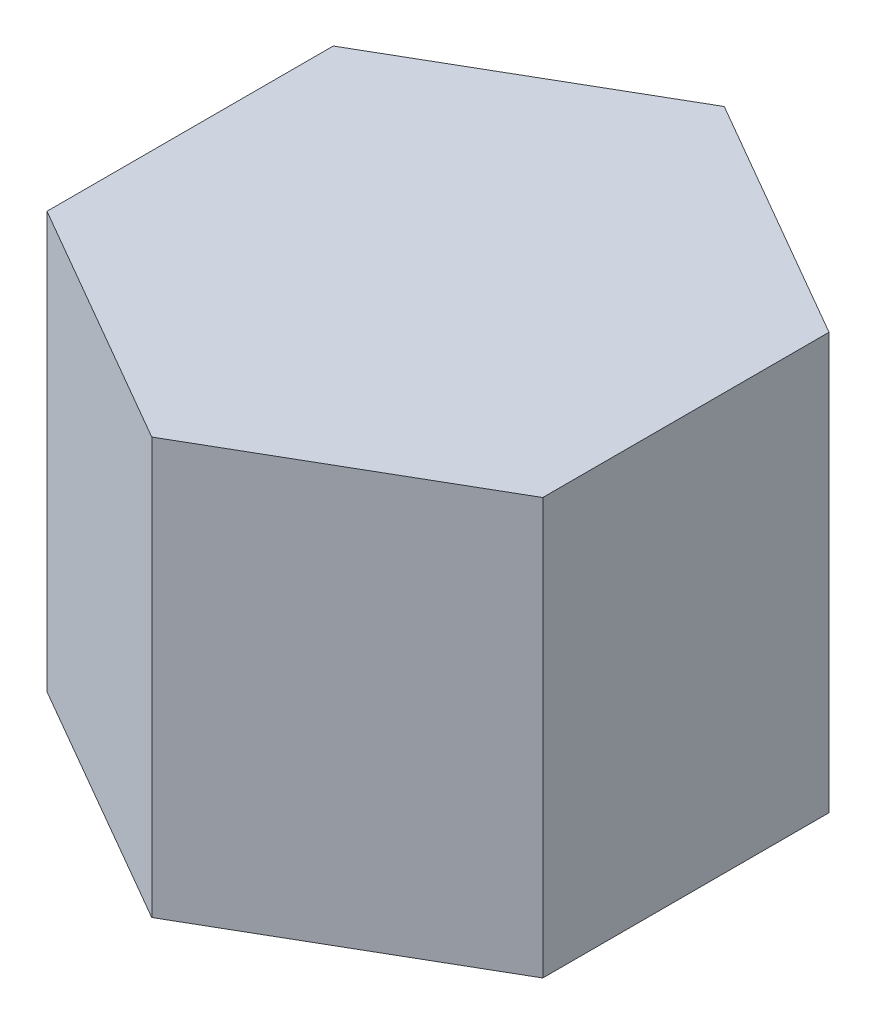
ISO-10303-21;
HEADER;
FILE_DESCRIPTION(('STEP AP214'),'2;1');
FILE_NAME('part.step','',(''),(''),'','','');
FILE_SCHEMA(('AUTOMOTIVE_DESIGN { 1 0 10303 214 1 1 1 1 }'));
ENDSEC;
DATA;
#1=APPLICATION_CONTEXT('core data for automotive mechanical design processes');
#2=APPLICATION_PROTOCOL_DEFINITION('international standard','automotive_design',2000,#1);
#3=PRODUCT_CONTEXT('',#1,'mechanical');
#4=PRODUCT('Part','Part','',(#3));
#5=PRODUCT_RELATED_PRODUCT_CATEGORY('part','',(#4));
#6=PRODUCT_DEFINITION_FORMATION('','',#4);
#7=PRODUCT_DEFINITION_CONTEXT('part definition',#1,'design');
#8=PRODUCT_DEFINITION('design','',#6,#7);
#9=PRODUCT_DEFINITION_SHAPE('','',#8);
#10=(LENGTH_UNIT() NAMED_UNIT(*) SI_UNIT(.MILLI.,.METRE.));
#11=(NAMED_UNIT(*) PLANE_ANGLE_UNIT() SI_UNIT($,.RADIAN.));
#12=(NAMED_UNIT(*) SI_UNIT($,.STERADIAN.) SOLID_ANGLE_UNIT());
#13=UNCERTAINTY_MEASURE_WITH_UNIT(LENGTH_MEASURE(1.E-05),#10,'distance_accuracy_value','');
#14=(GEOMETRIC_REPRESENTATION_CONTEXT(3) GLOBAL_UNCERTAINTY_ASSIGNED_CONTEXT((#13)) GLOBAL_UNIT_ASSIGNED_CONTEXT((#10,
#11,#12)) REPRESENTATION_CONTEXT('',''));
#15=CARTESIAN_POINT('',(0.,0.,0.));
#16=DIRECTION('',(0.,0.,1.));
#17=DIRECTION('',(1.,0.,0.));
#18=AXIS2_PLACEMENT_3D('',#15,#16,#17);
#19=CARTESIAN_POINT('',(208.839551417381,-147.556598747966,296.012098239417));
#20=DIRECTION('',(-0.500000000000062,0.,-0.866025403784403));
#21=DIRECTION('',(-0.866025403784403,0.,0.500000000000062));
#22=AXIS2_PLACEMENT_3D('',#19,#20,#21);
#23=PLANE('',#22);
#24=CARTESIAN_POINT('',(209.142660308706,-147.047793579175,295.837098239417));
#25=DIRECTION('',(-0.866025403784403,0.,0.500000000000062));
#26=VECTOR('',#25,1.);
#27=LINE('',#24,#26);
#28=CARTESIAN_POINT('',(209.142660308706,-147.047793579175,295.837098239417));
#29=VERTEX_POINT('',#28);
#30=CARTESIAN_POINT('',(208.839551417382,-147.047793579175,296.012098239417));
#31=VERTEX_POINT('',#30);
#32=EDGE_CURVE('E170',#29,#31,#27,.T.);
#33=ORIENTED_EDGE('',*,*,#32,.T.);
#34=CARTESIAN_POINT('',(208.839551417382,-147.556598747966,296.012098239417));
#35=DIRECTION('',(0.,1.,0.));
#36=VECTOR('',#35,1.);
#37=LINE('',#34,#36);
#38=CARTESIAN_POINT('',(208.839551417382,-147.556598747966,296.012098239417));
#39=VERTEX_POINT('',#38);
#40=EDGE_CURVE('E35',#39,#31,#37,.T.);
#41=ORIENTED_EDGE('',*,*,#40,.F.);
#42=CARTESIAN_POINT('',(209.142660308706,-147.556598747966,295.837098239417));
#43=DIRECTION('',(-0.866025403784403,0.,0.500000000000062));
#44=VECTOR('',#43,1.);
#45=LINE('',#42,#44);
#46=CARTESIAN_POINT('',(209.142660308706,-147.556598747966,295.837098239417));
#47=VERTEX_POINT('',#46);
#48=EDGE_CURVE('E159',#47,#39,#45,.T.);
#49=ORIENTED_EDGE('',*,*,#48,.F.);
#50=CARTESIAN_POINT('',(209.142660308706,-147.556598747966,295.837098239417));
#51=DIRECTION('',(0.,1.,0.));
#52=VECTOR('',#51,1.);
#53=LINE('',#50,#52);
#54=EDGE_CURVE('E10',#47,#29,#53,.T.);
#55=ORIENTED_EDGE('',*,*,#54,.T.);
#56=EDGE_LOOP('',(#33,#41,#49,#55));
#57=FACE_BOUND('',#56,.T.);
#58=ADVANCED_FACE('F16',(#57),#23,.F.);
#59=CARTESIAN_POINT('',(209.142660308706,-147.556598747966,291.594471220494));
#60=DIRECTION('',(-1.,0.,0.));
#61=DIRECTION('',(0.,-1.,0.));
#62=AXIS2_PLACEMENT_3D('',#59,#60,#61);
#63=PLANE('',#62);
#64=CARTESIAN_POINT('',(209.142660308706,-147.047793579175,295.487098239417));
#65=DIRECTION('',(0.,0.,1.));
#66=VECTOR('',#65,1.);
#67=LINE('',#64,#66);
#68=CARTESIAN_POINT('',(209.142660308706,-147.047793579175,295.487098239417));
#69=VERTEX_POINT('',#68);
#70=EDGE_CURVE('E167',#69,#29,#67,.T.);
#71=ORIENTED_EDGE('',*,*,#70,.T.);
#72=ORIENTED_EDGE('',*,*,#54,.F.);
#73=CARTESIAN_POINT('',(209.142660308706,-147.556598747966,295.487098239417));
#74=DIRECTION('',(0.,0.,1.));
#75=VECTOR('',#74,1.);
#76=LINE('',#73,#75);
#77=CARTESIAN_POINT('',(209.142660308706,-147.556598747966,295.487098239417));
#78=VERTEX_POINT('',#77);
#79=EDGE_CURVE('E156',#78,#47,#76,.T.);
#80=ORIENTED_EDGE('',*,*,#79,.F.);
#81=CARTESIAN_POINT('',(209.142660308706,-147.556598747966,295.487098239417));
#82=DIRECTION('',(0.,1.,0.));
#83=VECTOR('',#82,1.);
#84=LINE('',#81,#83);
#85=EDGE_CURVE('E27',#78,#69,#84,.T.);
#86=ORIENTED_EDGE('',*,*,#85,.T.);
#87=EDGE_LOOP('',(#71,#72,#80,#86));
#88=FACE_BOUND('',#87,.T.);
#89=ADVANCED_FACE('F189',(#88),#63,.F.);
#90=CARTESIAN_POINT('',(209.142660308706,-147.556598747966,295.487098239417));
#91=DIRECTION('',(-0.500000000000096,0.,0.866025403784383));
#92=DIRECTION('',(0.866025403784383,0.,0.500000000000096));
#93=AXIS2_PLACEMENT_3D('',#90,#91,#92);
#94=PLANE('',#93);
#95=CARTESIAN_POINT('',(208.839551417382,-147.047793579175,295.312098239417));
#96=DIRECTION('',(0.866025403784383,0.,0.500000000000096));
#97=VECTOR('',#96,1.);
#98=LINE('',#95,#97);
#99=CARTESIAN_POINT('',(208.839551417382,-147.047793579175,295.312098239417));
#100=VERTEX_POINT('',#99);
#101=EDGE_CURVE('E163',#100,#69,#98,.T.);
#102=ORIENTED_EDGE('',*,*,#101,.T.);
#103=ORIENTED_EDGE('',*,*,#85,.F.);
#104=CARTESIAN_POINT('',(208.839551417382,-147.556598747966,295.312098239417));
#105=DIRECTION('',(0.866025403784383,0.,0.500000000000096));
#106=VECTOR('',#105,1.);
#107=LINE('',#104,#106);
#108=CARTESIAN_POINT('',(208.839551417382,-147.556598747966,295.312098239417));
#109=VERTEX_POINT('',#108);
#110=EDGE_CURVE('E106',#109,#78,#107,.T.);
#111=ORIENTED_EDGE('',*,*,#110,.F.);
#112=CARTESIAN_POINT('',(208.839551417382,-147.556598747966,295.312098239417));
#113=DIRECTION('',(0.,1.,0.));
#114=VECTOR('',#113,1.);
#115=LINE('',#112,#114);
#116=EDGE_CURVE('E94',#109,#100,#115,.T.);
#117=ORIENTED_EDGE('',*,*,#116,.T.);
#118=EDGE_LOOP('',(#102,#103,#111,#117));
#119=FACE_BOUND('',#118,.T.);
#120=ADVANCED_FACE('F198',(#119),#94,.F.);
#121=CARTESIAN_POINT('',(208.839551417382,-147.556598747966,295.312098239417));
#122=DIRECTION('',(0.499999999999978,0.,0.866025403784452));
#123=DIRECTION('',(0.866025403784452,0.,-0.499999999999978));
#124=AXIS2_PLACEMENT_3D('',#121,#122,#123);
#125=PLANE('',#124);
#126=CARTESIAN_POINT('',(208.536442526057,-147.047793579175,295.487098239417));
#127=DIRECTION('',(0.866025403784452,0.,-0.499999999999978));
#128=VECTOR('',#127,1.);
#129=LINE('',#126,#128);
#130=CARTESIAN_POINT('',(208.536442526057,-147.047793579175,295.487098239417));
#131=VERTEX_POINT('',#130);
#132=EDGE_CURVE('E162',#131,#100,#129,.T.);
#133=ORIENTED_EDGE('',*,*,#132,.T.);
#134=ORIENTED_EDGE('',*,*,#116,.F.);
#135=CARTESIAN_POINT('',(208.536442526057,-147.556598747966,295.487098239417));
#136=DIRECTION('',(0.866025403784452,0.,-0.499999999999978));
#137=VECTOR('',#136,1.);
#138=LINE('',#135,#137);
#139=CARTESIAN_POINT('',(208.536442526057,-147.556598747966,295.487098239417));
#140=VERTEX_POINT('',#139);
#141=EDGE_CURVE('E98',#140,#109,#138,.T.);
#142=ORIENTED_EDGE('',*,*,#141,.F.);
#143=CARTESIAN_POINT('',(208.536442526057,-147.556598747966,295.487098239417));
#144=DIRECTION('',(0.,1.,0.));
#145=VECTOR('',#144,1.);
#146=LINE('',#143,#145);
#147=EDGE_CURVE('E79',#140,#131,#146,.T.);
#148=ORIENTED_EDGE('',*,*,#147,.T.);
#149=EDGE_LOOP('',(#133,#134,#142,#148));
#150=FACE_BOUND('',#149,.T.);
#151=ADVANCED_FACE('F100',(#150),#125,.F.);
#152=CARTESIAN_POINT('',(208.536442526057,-147.556598747966,291.594471220494));
#153=DIRECTION('',(1.,0.,0.));
#154=DIRECTION('',(0.,1.,0.));
#155=AXIS2_PLACEMENT_3D('',#152,#153,#154);
#156=PLANE('',#155);
#157=CARTESIAN_POINT('',(208.536442526057,-147.047793579175,295.837098239417));
#158=DIRECTION('',(0.,0.,-1.));
#159=VECTOR('',#158,1.);
#160=LINE('',#157,#159);
#161=CARTESIAN_POINT('',(208.536442526057,-147.047793579175,295.837098239417));
#162=VERTEX_POINT('',#161);
#163=EDGE_CURVE('E88',#162,#131,#160,.T.);
#164=ORIENTED_EDGE('',*,*,#163,.T.);
#165=ORIENTED_EDGE('',*,*,#147,.F.);
#166=CARTESIAN_POINT('',(208.536442526057,-147.556598747966,295.837098239417));
#167=DIRECTION('',(0.,0.,-1.));
#168=VECTOR('',#167,1.);
#169=LINE('',#166,#168);
#170=CARTESIAN_POINT('',(208.536442526057,-147.556598747966,295.837098239417));
#171=VERTEX_POINT('',#170);
#172=EDGE_CURVE('E84',#171,#140,#169,.T.);
#173=ORIENTED_EDGE('',*,*,#172,.F.);
#174=CARTESIAN_POINT('',(208.536442526057,-147.556598747966,295.837098239417));
#175=DIRECTION('',(0.,1.,0.));
#176=VECTOR('',#175,1.);
#177=LINE('',#174,#176);
#178=EDGE_CURVE('E58',#171,#162,#177,.T.);
#179=ORIENTED_EDGE('',*,*,#178,.T.);
#180=EDGE_LOOP('',(#164,#165,#173,#179));
#181=FACE_BOUND('',#180,.T.);
#182=ADVANCED_FACE('F82',(#181),#156,.F.);
#183=CARTESIAN_POINT('',(208.536442526057,-147.556598747966,295.837098239417));
#184=DIRECTION('',(0.500000000000062,0.,-0.866025403784403));
#185=DIRECTION('',(-0.866025403784403,0.,-0.500000000000062));
#186=AXIS2_PLACEMENT_3D('',#183,#184,#185);
#187=PLANE('',#186);
#188=CARTESIAN_POINT('',(208.839551417382,-147.047793579175,296.012098239417));
#189=DIRECTION('',(-0.866025403784403,0.,-0.500000000000062));
#190=VECTOR('',#189,1.);
#191=LINE('',#188,#190);
#192=EDGE_CURVE('E160',#31,#162,#191,.T.);
#193=ORIENTED_EDGE('',*,*,#192,.T.);
#194=ORIENTED_EDGE('',*,*,#178,.F.);
#195=CARTESIAN_POINT('',(208.839551417382,-147.556598747966,296.012098239417));
#196=DIRECTION('',(-0.866025403784403,0.,-0.500000000000062));
#197=VECTOR('',#196,1.);
#198=LINE('',#195,#197);
#199=EDGE_CURVE('E112',#39,#171,#198,.T.);
#200=ORIENTED_EDGE('',*,*,#199,.F.);
#201=ORIENTED_EDGE('',*,*,#40,.T.);
#202=EDGE_LOOP('',(#193,#194,#200,#201));
#203=FACE_BOUND('',#202,.T.);
#204=ADVANCED_FACE('F131',(#203),#187,.F.);
#205=CARTESIAN_POINT('',(206.491105863044,-147.556598747966,291.594471220494));
#206=DIRECTION('',(0.,1.,0.));
#207=DIRECTION('',(-1.,0.,0.));
#208=AXIS2_PLACEMENT_3D('',#205,#206,#207);
#209=PLANE('',#208);
#210=ORIENTED_EDGE('',*,*,#48,.T.);
#211=ORIENTED_EDGE('',*,*,#199,.T.);
#212=ORIENTED_EDGE('',*,*,#172,.T.);
#213=ORIENTED_EDGE('',*,*,#141,.T.);
#214=ORIENTED_EDGE('',*,*,#110,.T.);
#215=ORIENTED_EDGE('',*,*,#79,.T.);
#216=EDGE_LOOP('',(#210,#211,#212,#213,#214,#215));
#217=FACE_BOUND('',#216,.T.);
#218=ADVANCED_FACE('F111',(#217),#209,.F.);
#219=CARTESIAN_POINT('',(206.491105863044,-147.047793579175,291.594471220494));
#220=DIRECTION('',(0.,1.,0.));
#221=DIRECTION('',(-1.,0.,0.));
#222=AXIS2_PLACEMENT_3D('',#219,#220,#221);
#223=PLANE('',#222);
#224=ORIENTED_EDGE('',*,*,#32,.F.);
#225=ORIENTED_EDGE('',*,*,#70,.F.);
#226=ORIENTED_EDGE('',*,*,#101,.F.);
#227=ORIENTED_EDGE('',*,*,#132,.F.);
#228=ORIENTED_EDGE('',*,*,#163,.F.);
#229=ORIENTED_EDGE('',*,*,#192,.F.);
#230=EDGE_LOOP('',(#224,#225,#226,#227,#228,#229));
#231=FACE_BOUND('',#230,.T.);
#232=ADVANCED_FACE('F130',(#231),#223,.T.);
#233=CLOSED_SHELL('',(#58,#89,#120,#151,#182,#204,#218,#232));
#234=MANIFOLD_SOLID_BREP('B1',#233);
#235=ADVANCED_BREP_SHAPE_REPRESENTATION('',(#18,#234),#14);
#236=SHAPE_DEFINITION_REPRESENTATION(#9,#235);
ENDSEC;
END-ISO-10303-21;
